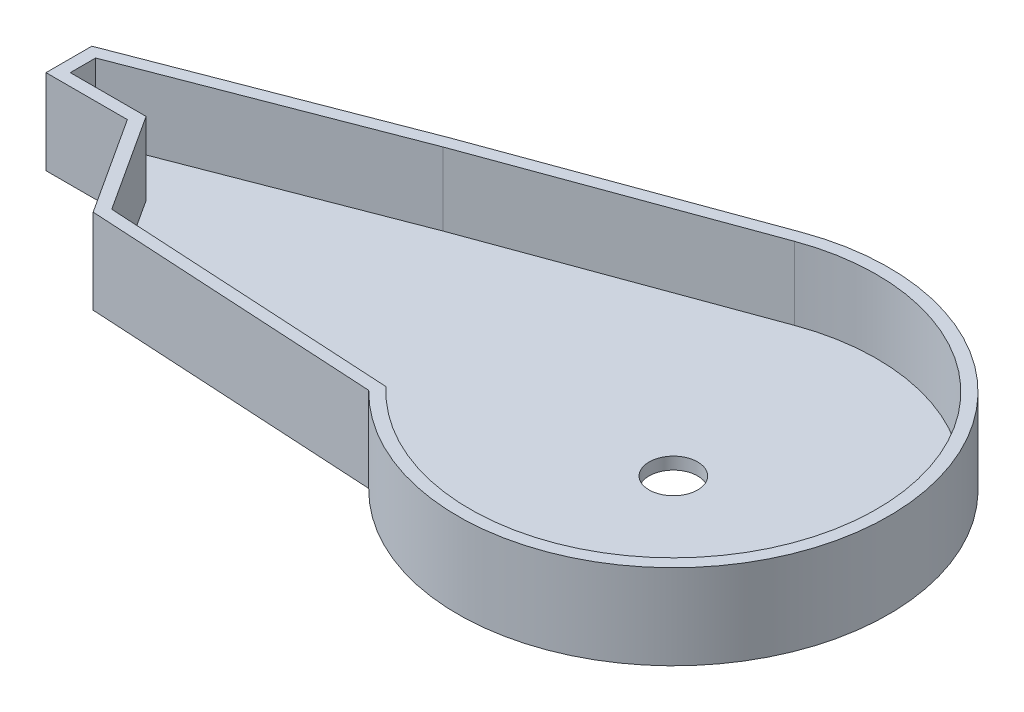
ISO-10303-21;
HEADER;
FILE_DESCRIPTION(('STEP AP214'),'2;1');
FILE_NAME('part.step','',(''),(''),'','','');
FILE_SCHEMA(('AUTOMOTIVE_DESIGN { 1 0 10303 214 1 1 1 1 }'));
ENDSEC;
DATA;
#1=APPLICATION_CONTEXT('core data for automotive mechanical design processes');
#2=APPLICATION_PROTOCOL_DEFINITION('international standard','automotive_design',2000,#1);
#3=PRODUCT_CONTEXT('',#1,'mechanical');
#4=PRODUCT('Part','Part','',(#3));
#5=PRODUCT_RELATED_PRODUCT_CATEGORY('part','',(#4));
#6=PRODUCT_DEFINITION_FORMATION('','',#4);
#7=PRODUCT_DEFINITION_CONTEXT('part definition',#1,'design');
#8=PRODUCT_DEFINITION('design','',#6,#7);
#9=PRODUCT_DEFINITION_SHAPE('','',#8);
#10=(LENGTH_UNIT() NAMED_UNIT(*) SI_UNIT(.MILLI.,.METRE.));
#11=(NAMED_UNIT(*) PLANE_ANGLE_UNIT() SI_UNIT($,.RADIAN.));
#12=(NAMED_UNIT(*) SI_UNIT($,.STERADIAN.) SOLID_ANGLE_UNIT());
#13=UNCERTAINTY_MEASURE_WITH_UNIT(LENGTH_MEASURE(1.E-05),#10,'distance_accuracy_value','');
#14=(GEOMETRIC_REPRESENTATION_CONTEXT(3) GLOBAL_UNCERTAINTY_ASSIGNED_CONTEXT((#13)) GLOBAL_UNIT_ASSIGNED_CONTEXT((#10,
#11,#12)) REPRESENTATION_CONTEXT('',''));
#15=CARTESIAN_POINT('',(0.,0.,0.));
#16=DIRECTION('',(0.,0.,1.));
#17=DIRECTION('',(1.,0.,0.));
#18=AXIS2_PLACEMENT_3D('',#15,#16,#17);
#19=CARTESIAN_POINT('',(0.,17.78,0.));
#20=DIRECTION('',(0.,-1.,0.));
#21=DIRECTION('',(0.,0.,-1.));
#22=AXIS2_PLACEMENT_3D('',#19,#20,#21);
#23=CYLINDRICAL_SURFACE('',#22,5.08);
#24=CARTESIAN_POINT('',(0.,0.,0.));
#25=DIRECTION('',(0.,1.,0.));
#26=DIRECTION('',(0.,0.,1.));
#27=AXIS2_PLACEMENT_3D('',#24,#25,#26);
#28=CIRCLE('',#27,5.08);
#29=CARTESIAN_POINT('',(0.,0.,5.08));
#30=VERTEX_POINT('',#29);
#31=EDGE_CURVE('E141',#30,#30,#28,.T.);
#32=ORIENTED_EDGE('',*,*,#31,.F.);
#33=EDGE_LOOP('',(#32));
#34=FACE_BOUND('',#33,.T.);
#35=CARTESIAN_POINT('',(0.,2.54,0.));
#36=DIRECTION('',(0.,1.,0.));
#37=DIRECTION('',(0.,0.,1.));
#38=AXIS2_PLACEMENT_3D('',#35,#36,#37);
#39=CIRCLE('',#38,5.08);
#40=CARTESIAN_POINT('',(0.,2.54,5.08));
#41=VERTEX_POINT('',#40);
#42=EDGE_CURVE('E37',#41,#41,#39,.T.);
#43=ORIENTED_EDGE('',*,*,#42,.T.);
#44=EDGE_LOOP('',(#43));
#45=FACE_BOUND('',#44,.T.);
#46=ADVANCED_FACE('F33',(#34,#45),#23,.F.);
#47=CARTESIAN_POINT('',(0.,17.78,0.));
#48=DIRECTION('',(0.,1.,0.));
#49=DIRECTION('',(0.,0.,1.));
#50=AXIS2_PLACEMENT_3D('',#47,#48,#49);
#51=PLANE('',#50);
#52=CARTESIAN_POINT('',(0.,17.78,0.));
#53=DIRECTION('',(0.,1.,0.));
#54=DIRECTION('',(0.,0.,1.));
#55=AXIS2_PLACEMENT_3D('',#52,#53,#54);
#56=CIRCLE('',#55,42.545);
#57=CARTESIAN_POINT('',(-31.0140610014513,17.78,29.1239599848348));
#58=VERTEX_POINT('',#57);
#59=CARTESIAN_POINT('',(-14.5990451481157,17.78,-39.961793074927));
#60=VERTEX_POINT('',#59);
#61=EDGE_CURVE('E49',#58,#60,#56,.T.);
#62=ORIENTED_EDGE('',*,*,#61,.F.);
#63=DIRECTION('',(0.998397836065701,0.,0.0565841050059614));
#64=VECTOR('',#63,1.);
#65=CARTESIAN_POINT('',(-91.8513296053998,17.78,25.6760134142303));
#66=LINE('',#65,#64);
#67=CARTESIAN_POINT('',(-91.8513296053998,17.78,25.6760134142303));
#68=VERTEX_POINT('',#67);
#69=EDGE_CURVE('E198',#68,#58,#66,.T.);
#70=ORIENTED_EDGE('',*,*,#69,.F.);
#71=DIRECTION('',(0.543953149792658,0.,0.839115588480303));
#72=VECTOR('',#71,1.);
#73=CARTESIAN_POINT('',(-105.090165624104,17.78,5.25345738920635));
#74=LINE('',#73,#72);
#75=CARTESIAN_POINT('',(-105.090165624104,17.78,5.25345738920635));
#76=VERTEX_POINT('',#75);
#77=EDGE_CURVE('E202',#76,#68,#74,.T.);
#78=ORIENTED_EDGE('',*,*,#77,.F.);
#79=DIRECTION('',(1.,0.,0.));
#80=VECTOR('',#79,1.);
#81=CARTESIAN_POINT('',(-120.956324782808,17.78,5.25345738920635));
#82=LINE('',#81,#80);
#83=CARTESIAN_POINT('',(-120.956324782808,17.78,5.25345738920635));
#84=VERTEX_POINT('',#83);
#85=EDGE_CURVE('E205',#84,#76,#82,.T.);
#86=ORIENTED_EDGE('',*,*,#85,.F.);
#87=DIRECTION('',(0.,0.,1.));
#88=VECTOR('',#87,1.);
#89=CARTESIAN_POINT('',(-120.956324782808,17.78,-0.0552304426092067));
#90=LINE('',#89,#88);
#91=CARTESIAN_POINT('',(-120.956324782808,17.78,-0.0552304426092067));
#92=VERTEX_POINT('',#91);
#93=EDGE_CURVE('E208',#92,#84,#90,.T.);
#94=ORIENTED_EDGE('',*,*,#93,.F.);
#95=DIRECTION('',(-0.933112963053806,0.,0.359583367497646));
#96=VECTOR('',#95,1.);
#97=CARTESIAN_POINT('',(-68.4659826084911,17.78,-20.2828499779477));
#98=LINE('',#97,#96);
#99=CARTESIAN_POINT('',(-68.4659826084911,17.78,-20.2828499779477));
#100=VERTEX_POINT('',#99);
#101=EDGE_CURVE('E211',#100,#92,#98,.T.);
#102=ORIENTED_EDGE('',*,*,#101,.F.);
#103=DIRECTION('',(-0.93928294922851,0.,0.343143616126824));
#104=VECTOR('',#103,1.);
#105=CARTESIAN_POINT('',(-14.5990451481157,17.78,-39.9617930749269));
#106=LINE('',#105,#104);
#107=EDGE_CURVE('E214',#60,#100,#106,.T.);
#108=ORIENTED_EDGE('',*,*,#107,.F.);
#109=EDGE_LOOP('',(#62,#70,#78,#86,#94,#102,#108));
#110=FACE_BOUND('',#109,.T.);
#111=CARTESIAN_POINT('',(0.,17.78,0.));
#112=DIRECTION('',(0.,1.,0.));
#113=DIRECTION('',(0.,0.,1.));
#114=AXIS2_PLACEMENT_3D('',#111,#112,#113);
#115=CIRCLE('',#114,45.085);
#116=CARTESIAN_POINT('',(-32.1540117994862,17.78,31.6034294056594));
#117=VERTEX_POINT('',#116);
#118=CARTESIAN_POINT('',(-15.4706299330779,17.78,-42.3475717659673));
#119=VERTEX_POINT('',#118);
#120=EDGE_CURVE('E151',#117,#119,#115,.T.);
#121=ORIENTED_EDGE('',*,*,#120,.T.);
#122=DIRECTION('',(-0.93928294922851,0.,0.343143616126824));
#123=VECTOR('',#122,1.);
#124=CARTESIAN_POINT('',(-15.4706299330779,17.78,-42.3475717659673));
#125=LINE('',#124,#123);
#126=CARTESIAN_POINT('',(-69.3585146772244,17.78,-22.6609761009231));
#127=VERTEX_POINT('',#126);
#128=EDGE_CURVE('E96',#119,#127,#125,.T.);
#129=ORIENTED_EDGE('',*,*,#128,.T.);
#130=DIRECTION('',(-0.933112963053806,0.,0.359583367497646));
#131=VECTOR('',#130,1.);
#132=CARTESIAN_POINT('',(-69.3585146772244,17.78,-22.6609761009231));
#133=LINE('',#132,#131);
#134=CARTESIAN_POINT('',(-123.496324782808,17.78,-1.79849016673993));
#135=VERTEX_POINT('',#134);
#136=EDGE_CURVE('E164',#127,#135,#133,.T.);
#137=ORIENTED_EDGE('',*,*,#136,.T.);
#138=DIRECTION('',(0.,0.,1.));
#139=VECTOR('',#138,1.);
#140=CARTESIAN_POINT('',(-123.496324782808,17.78,-1.79849016673993));
#141=LINE('',#140,#139);
#142=CARTESIAN_POINT('',(-123.496324782808,17.78,7.79345738920635));
#143=VERTEX_POINT('',#142);
#144=EDGE_CURVE('E116',#135,#143,#141,.T.);
#145=ORIENTED_EDGE('',*,*,#144,.T.);
#146=DIRECTION('',(1.,0.,0.));
#147=VECTOR('',#146,1.);
#148=CARTESIAN_POINT('',(-123.496324782808,17.78,7.79345738920635));
#149=LINE('',#148,#147);
#150=CARTESIAN_POINT('',(-106.470617871004,17.78,7.79345738920635));
#151=VERTEX_POINT('',#150);
#152=EDGE_CURVE('E109',#143,#151,#149,.T.);
#153=ORIENTED_EDGE('',*,*,#152,.T.);
#154=DIRECTION('',(0.543953149792658,0.,0.839115588480304));
#155=VECTOR('',#154,1.);
#156=CARTESIAN_POINT('',(-106.470617871004,17.78,7.79345738920635));
#157=LINE('',#156,#155);
#158=CARTESIAN_POINT('',(-93.2816899815776,17.78,28.1390238990769));
#159=VERTEX_POINT('',#158);
#160=EDGE_CURVE('E113',#151,#159,#157,.T.);
#161=ORIENTED_EDGE('',*,*,#160,.T.);
#162=DIRECTION('',(0.998397836065701,0.,0.0565841050059614));
#163=VECTOR('',#162,1.);
#164=CARTESIAN_POINT('',(-32.1540117994862,17.78,31.6034294056594));
#165=LINE('',#164,#163);
#166=EDGE_CURVE('E58',#159,#117,#165,.T.);
#167=ORIENTED_EDGE('',*,*,#166,.T.);
#168=EDGE_LOOP('',(#121,#129,#137,#145,#153,#161,#167));
#169=FACE_BOUND('',#168,.T.);
#170=ADVANCED_FACE('F111',(#110,#169),#51,.T.);
#171=CARTESIAN_POINT('',(0.,0.,0.));
#172=DIRECTION('',(0.,1.,0.));
#173=DIRECTION('',(0.,0.,1.));
#174=AXIS2_PLACEMENT_3D('',#171,#172,#173);
#175=PLANE('',#174);
#176=CARTESIAN_POINT('',(0.,0.,0.));
#177=DIRECTION('',(0.,1.,0.));
#178=DIRECTION('',(0.,0.,1.));
#179=AXIS2_PLACEMENT_3D('',#176,#177,#178);
#180=CIRCLE('',#179,45.085);
#181=CARTESIAN_POINT('',(-32.1540117994862,0.,31.6034294056594));
#182=VERTEX_POINT('',#181);
#183=CARTESIAN_POINT('',(-15.4706299330779,0.,-42.3475717659673));
#184=VERTEX_POINT('',#183);
#185=EDGE_CURVE('E137',#182,#184,#180,.T.);
#186=ORIENTED_EDGE('',*,*,#185,.F.);
#187=DIRECTION('',(0.998397836065701,0.,0.0565841050059614));
#188=VECTOR('',#187,1.);
#189=CARTESIAN_POINT('',(-32.1540117994862,0.,31.6034294056594));
#190=LINE('',#189,#188);
#191=CARTESIAN_POINT('',(-93.2816899815776,0.,28.1390238990769));
#192=VERTEX_POINT('',#191);
#193=EDGE_CURVE('E88',#192,#182,#190,.T.);
#194=ORIENTED_EDGE('',*,*,#193,.F.);
#195=DIRECTION('',(0.543953149792658,0.,0.839115588480304));
#196=VECTOR('',#195,1.);
#197=CARTESIAN_POINT('',(-106.470617871004,0.,7.79345738920635));
#198=LINE('',#197,#196);
#199=CARTESIAN_POINT('',(-106.470617871004,0.,7.79345738920635));
#200=VERTEX_POINT('',#199);
#201=EDGE_CURVE('E148',#200,#192,#198,.T.);
#202=ORIENTED_EDGE('',*,*,#201,.F.);
#203=DIRECTION('',(1.,0.,0.));
#204=VECTOR('',#203,1.);
#205=CARTESIAN_POINT('',(-123.496324782808,0.,7.79345738920635));
#206=LINE('',#205,#204);
#207=CARTESIAN_POINT('',(-123.496324782808,0.,7.79345738920635));
#208=VERTEX_POINT('',#207);
#209=EDGE_CURVE('E125',#208,#200,#206,.T.);
#210=ORIENTED_EDGE('',*,*,#209,.F.);
#211=DIRECTION('',(0.,0.,1.));
#212=VECTOR('',#211,1.);
#213=CARTESIAN_POINT('',(-123.496324782808,0.,-1.79849016673993));
#214=LINE('',#213,#212);
#215=CARTESIAN_POINT('',(-123.496324782808,0.,-1.79849016673993));
#216=VERTEX_POINT('',#215);
#217=EDGE_CURVE('E145',#216,#208,#214,.T.);
#218=ORIENTED_EDGE('',*,*,#217,.F.);
#219=DIRECTION('',(-0.933112963053806,0.,0.359583367497646));
#220=VECTOR('',#219,1.);
#221=CARTESIAN_POINT('',(-69.3585146772244,0.,-22.6609761009231));
#222=LINE('',#221,#220);
#223=CARTESIAN_POINT('',(-69.3585146772244,0.,-22.6609761009231));
#224=VERTEX_POINT('',#223);
#225=EDGE_CURVE('E143',#224,#216,#222,.T.);
#226=ORIENTED_EDGE('',*,*,#225,.F.);
#227=DIRECTION('',(-0.93928294922851,0.,0.343143616126824));
#228=VECTOR('',#227,1.);
#229=CARTESIAN_POINT('',(-15.4706299330779,0.,-42.3475717659673));
#230=LINE('',#229,#228);
#231=EDGE_CURVE('E140',#184,#224,#230,.T.);
#232=ORIENTED_EDGE('',*,*,#231,.F.);
#233=EDGE_LOOP('',(#186,#194,#202,#210,#218,#226,#232));
#234=FACE_BOUND('',#233,.T.);
#235=ORIENTED_EDGE('',*,*,#31,.T.);
#236=EDGE_LOOP('',(#235));
#237=FACE_BOUND('',#236,.T.);
#238=ADVANCED_FACE('F168',(#234,#237),#175,.F.);
#239=CARTESIAN_POINT('',(0.,17.78,0.));
#240=DIRECTION('',(0.,-1.,0.));
#241=DIRECTION('',(0.,0.,-1.));
#242=AXIS2_PLACEMENT_3D('',#239,#240,#241);
#243=CYLINDRICAL_SURFACE('',#242,45.085);
#244=ORIENTED_EDGE('',*,*,#185,.T.);
#245=DIRECTION('',(0.,-1.,0.));
#246=VECTOR('',#245,1.);
#247=CARTESIAN_POINT('',(-15.4706299330779,17.78,-42.3475717659673));
#248=LINE('',#247,#246);
#249=EDGE_CURVE('E11',#119,#184,#248,.T.);
#250=ORIENTED_EDGE('',*,*,#249,.F.);
#251=ORIENTED_EDGE('',*,*,#120,.F.);
#252=DIRECTION('',(0.,-1.,0.));
#253=VECTOR('',#252,1.);
#254=CARTESIAN_POINT('',(-32.1540117994862,17.78,31.6034294056594));
#255=LINE('',#254,#253);
#256=EDGE_CURVE('E133',#117,#182,#255,.T.);
#257=ORIENTED_EDGE('',*,*,#256,.T.);
#258=EDGE_LOOP('',(#244,#250,#251,#257));
#259=FACE_BOUND('',#258,.T.);
#260=ADVANCED_FACE('F35',(#259),#243,.T.);
#261=CARTESIAN_POINT('',(-15.4706299330779,17.78,-42.3475717659673));
#262=DIRECTION('',(0.343143616126824,0.,0.93928294922851));
#263=DIRECTION('',(0.93928294922851,0.,-0.343143616126824));
#264=AXIS2_PLACEMENT_3D('',#261,#262,#263);
#265=PLANE('',#264);
#266=ORIENTED_EDGE('',*,*,#231,.T.);
#267=DIRECTION('',(0.,-1.,0.));
#268=VECTOR('',#267,1.);
#269=CARTESIAN_POINT('',(-69.3585146772244,17.78,-22.6609761009231));
#270=LINE('',#269,#268);
#271=EDGE_CURVE('E42',#127,#224,#270,.T.);
#272=ORIENTED_EDGE('',*,*,#271,.F.);
#273=ORIENTED_EDGE('',*,*,#128,.F.);
#274=ORIENTED_EDGE('',*,*,#249,.T.);
#275=EDGE_LOOP('',(#266,#272,#273,#274));
#276=FACE_BOUND('',#275,.T.);
#277=ADVANCED_FACE('F325',(#276),#265,.F.);
#278=CARTESIAN_POINT('',(-69.3585146772244,17.78,-22.6609761009231));
#279=DIRECTION('',(0.359583367497646,0.,0.933112963053805));
#280=DIRECTION('',(0.933112963053806,0.,-0.359583367497646));
#281=AXIS2_PLACEMENT_3D('',#278,#279,#280);
#282=PLANE('',#281);
#283=ORIENTED_EDGE('',*,*,#225,.T.);
#284=DIRECTION('',(0.,-1.,0.));
#285=VECTOR('',#284,1.);
#286=CARTESIAN_POINT('',(-123.496324782808,17.78,-1.79849016673993));
#287=LINE('',#286,#285);
#288=EDGE_CURVE('E155',#135,#216,#287,.T.);
#289=ORIENTED_EDGE('',*,*,#288,.F.);
#290=ORIENTED_EDGE('',*,*,#136,.F.);
#291=ORIENTED_EDGE('',*,*,#271,.T.);
#292=EDGE_LOOP('',(#283,#289,#290,#291));
#293=FACE_BOUND('',#292,.T.);
#294=ADVANCED_FACE('F162',(#293),#282,.F.);
#295=CARTESIAN_POINT('',(-123.496324782808,17.78,-1.79849016673993));
#296=DIRECTION('',(1.,0.,0.));
#297=DIRECTION('',(0.,0.,-1.));
#298=AXIS2_PLACEMENT_3D('',#295,#296,#297);
#299=PLANE('',#298);
#300=ORIENTED_EDGE('',*,*,#217,.T.);
#301=DIRECTION('',(0.,-1.,0.));
#302=VECTOR('',#301,1.);
#303=CARTESIAN_POINT('',(-123.496324782808,17.78,7.79345738920635));
#304=LINE('',#303,#302);
#305=EDGE_CURVE('E128',#143,#208,#304,.T.);
#306=ORIENTED_EDGE('',*,*,#305,.F.);
#307=ORIENTED_EDGE('',*,*,#144,.F.);
#308=ORIENTED_EDGE('',*,*,#288,.T.);
#309=EDGE_LOOP('',(#300,#306,#307,#308));
#310=FACE_BOUND('',#309,.T.);
#311=ADVANCED_FACE('F171',(#310),#299,.F.);
#312=CARTESIAN_POINT('',(-123.496324782808,17.78,7.79345738920635));
#313=DIRECTION('',(0.,0.,-1.));
#314=DIRECTION('',(-1.,0.,0.));
#315=AXIS2_PLACEMENT_3D('',#312,#313,#314);
#316=PLANE('',#315);
#317=ORIENTED_EDGE('',*,*,#209,.T.);
#318=DIRECTION('',(0.,-1.,0.));
#319=VECTOR('',#318,1.);
#320=CARTESIAN_POINT('',(-106.470617871004,17.78,7.79345738920635));
#321=LINE('',#320,#319);
#322=EDGE_CURVE('E122',#151,#200,#321,.T.);
#323=ORIENTED_EDGE('',*,*,#322,.F.);
#324=ORIENTED_EDGE('',*,*,#152,.F.);
#325=ORIENTED_EDGE('',*,*,#305,.T.);
#326=EDGE_LOOP('',(#317,#323,#324,#325));
#327=FACE_BOUND('',#326,.T.);
#328=ADVANCED_FACE('F123',(#327),#316,.F.);
#329=CARTESIAN_POINT('',(-106.470617871004,17.78,7.79345738920635));
#330=DIRECTION('',(0.839115588480304,0.,-0.543953149792658));
#331=DIRECTION('',(-0.543953149792658,0.,-0.839115588480304));
#332=AXIS2_PLACEMENT_3D('',#329,#330,#331);
#333=PLANE('',#332);
#334=ORIENTED_EDGE('',*,*,#201,.T.);
#335=DIRECTION('',(0.,-1.,0.));
#336=VECTOR('',#335,1.);
#337=CARTESIAN_POINT('',(-93.2816899815776,17.78,28.1390238990769));
#338=LINE('',#337,#336);
#339=EDGE_CURVE('E129',#159,#192,#338,.T.);
#340=ORIENTED_EDGE('',*,*,#339,.F.);
#341=ORIENTED_EDGE('',*,*,#160,.F.);
#342=ORIENTED_EDGE('',*,*,#322,.T.);
#343=EDGE_LOOP('',(#334,#340,#341,#342));
#344=FACE_BOUND('',#343,.T.);
#345=ADVANCED_FACE('F131',(#344),#333,.F.);
#346=CARTESIAN_POINT('',(-32.1540117994862,17.78,31.6034294056594));
#347=DIRECTION('',(0.0565841050059614,0.,-0.998397836065701));
#348=DIRECTION('',(-0.998397836065701,0.,-0.0565841050059614));
#349=AXIS2_PLACEMENT_3D('',#346,#347,#348);
#350=PLANE('',#349);
#351=ORIENTED_EDGE('',*,*,#193,.T.);
#352=ORIENTED_EDGE('',*,*,#256,.F.);
#353=ORIENTED_EDGE('',*,*,#166,.F.);
#354=ORIENTED_EDGE('',*,*,#339,.T.);
#355=EDGE_LOOP('',(#351,#352,#353,#354));
#356=FACE_BOUND('',#355,.T.);
#357=ADVANCED_FACE('F315',(#356),#350,.F.);
#358=CARTESIAN_POINT('',(0.,2.54,0.));
#359=DIRECTION('',(0.,1.,0.));
#360=DIRECTION('',(0.,0.,1.));
#361=AXIS2_PLACEMENT_3D('',#358,#359,#360);
#362=CYLINDRICAL_SURFACE('',#361,42.545);
#363=ORIENTED_EDGE('',*,*,#61,.T.);
#364=DIRECTION('',(0.,1.,0.));
#365=VECTOR('',#364,1.);
#366=CARTESIAN_POINT('',(-14.5990451481157,2.54,-39.9617930749269));
#367=LINE('',#366,#365);
#368=CARTESIAN_POINT('',(-14.5990451481157,2.54,-39.9617930749269));
#369=VERTEX_POINT('',#368);
#370=EDGE_CURVE('E178',#369,#60,#367,.T.);
#371=ORIENTED_EDGE('',*,*,#370,.F.);
#372=CARTESIAN_POINT('',(0.,2.54,0.));
#373=DIRECTION('',(0.,1.,0.));
#374=DIRECTION('',(0.,0.,1.));
#375=AXIS2_PLACEMENT_3D('',#372,#373,#374);
#376=CIRCLE('',#375,42.545);
#377=CARTESIAN_POINT('',(-31.0140610014513,2.54,29.1239599848348));
#378=VERTEX_POINT('',#377);
#379=EDGE_CURVE('E201',#378,#369,#376,.T.);
#380=ORIENTED_EDGE('',*,*,#379,.F.);
#381=DIRECTION('',(0.,1.,0.));
#382=VECTOR('',#381,1.);
#383=CARTESIAN_POINT('',(-31.0140610014513,2.54,29.1239599848348));
#384=LINE('',#383,#382);
#385=EDGE_CURVE('E196',#378,#58,#384,.T.);
#386=ORIENTED_EDGE('',*,*,#385,.T.);
#387=EDGE_LOOP('',(#363,#371,#380,#386));
#388=FACE_BOUND('',#387,.T.);
#389=ADVANCED_FACE('F244',(#388),#362,.F.);
#390=CARTESIAN_POINT('',(-91.8513296053998,2.54,25.6760134142303));
#391=DIRECTION('',(-0.0565841050059614,0.,0.998397836065701));
#392=DIRECTION('',(0.998397836065701,0.,0.0565841050059614));
#393=AXIS2_PLACEMENT_3D('',#390,#391,#392);
#394=PLANE('',#393);
#395=ORIENTED_EDGE('',*,*,#69,.T.);
#396=ORIENTED_EDGE('',*,*,#385,.F.);
#397=DIRECTION('',(0.998397836065701,0.,0.0565841050059614));
#398=VECTOR('',#397,1.);
#399=CARTESIAN_POINT('',(-91.8513296053998,2.54,25.6760134142303));
#400=LINE('',#399,#398);
#401=CARTESIAN_POINT('',(-91.8513296053998,2.54,25.6760134142303));
#402=VERTEX_POINT('',#401);
#403=EDGE_CURVE('E181',#402,#378,#400,.T.);
#404=ORIENTED_EDGE('',*,*,#403,.F.);
#405=DIRECTION('',(0.,1.,0.));
#406=VECTOR('',#405,1.);
#407=CARTESIAN_POINT('',(-91.8513296053998,2.54,25.6760134142303));
#408=LINE('',#407,#406);
#409=EDGE_CURVE('E193',#402,#68,#408,.T.);
#410=ORIENTED_EDGE('',*,*,#409,.T.);
#411=EDGE_LOOP('',(#395,#396,#404,#410));
#412=FACE_BOUND('',#411,.T.);
#413=ADVANCED_FACE('F262',(#412),#394,.F.);
#414=CARTESIAN_POINT('',(-105.090165624104,2.54,5.25345738920635));
#415=DIRECTION('',(-0.839115588480303,0.,0.543953149792658));
#416=DIRECTION('',(0.543953149792658,0.,0.839115588480303));
#417=AXIS2_PLACEMENT_3D('',#414,#415,#416);
#418=PLANE('',#417);
#419=ORIENTED_EDGE('',*,*,#77,.T.);
#420=ORIENTED_EDGE('',*,*,#409,.F.);
#421=DIRECTION('',(0.543953149792658,0.,0.839115588480303));
#422=VECTOR('',#421,1.);
#423=CARTESIAN_POINT('',(-105.090165624104,2.54,5.25345738920635));
#424=LINE('',#423,#422);
#425=CARTESIAN_POINT('',(-105.090165624104,2.54,5.25345738920635));
#426=VERTEX_POINT('',#425);
#427=EDGE_CURVE('E220',#426,#402,#424,.T.);
#428=ORIENTED_EDGE('',*,*,#427,.F.);
#429=DIRECTION('',(0.,1.,0.));
#430=VECTOR('',#429,1.);
#431=CARTESIAN_POINT('',(-105.090165624104,2.54,5.25345738920635));
#432=LINE('',#431,#430);
#433=EDGE_CURVE('E190',#426,#76,#432,.T.);
#434=ORIENTED_EDGE('',*,*,#433,.T.);
#435=EDGE_LOOP('',(#419,#420,#428,#434));
#436=FACE_BOUND('',#435,.T.);
#437=ADVANCED_FACE('F267',(#436),#418,.F.);
#438=CARTESIAN_POINT('',(-120.956324782808,2.54,5.25345738920635));
#439=DIRECTION('',(0.,0.,1.));
#440=DIRECTION('',(1.,0.,0.));
#441=AXIS2_PLACEMENT_3D('',#438,#439,#440);
#442=PLANE('',#441);
#443=ORIENTED_EDGE('',*,*,#85,.T.);
#444=ORIENTED_EDGE('',*,*,#433,.F.);
#445=DIRECTION('',(1.,0.,0.));
#446=VECTOR('',#445,1.);
#447=CARTESIAN_POINT('',(-120.956324782808,2.54,5.25345738920635));
#448=LINE('',#447,#446);
#449=CARTESIAN_POINT('',(-120.956324782808,2.54,5.25345738920635));
#450=VERTEX_POINT('',#449);
#451=EDGE_CURVE('E223',#450,#426,#448,.T.);
#452=ORIENTED_EDGE('',*,*,#451,.F.);
#453=DIRECTION('',(0.,1.,0.));
#454=VECTOR('',#453,1.);
#455=CARTESIAN_POINT('',(-120.956324782808,2.54,5.25345738920635));
#456=LINE('',#455,#454);
#457=EDGE_CURVE('E187',#450,#84,#456,.T.);
#458=ORIENTED_EDGE('',*,*,#457,.T.);
#459=EDGE_LOOP('',(#443,#444,#452,#458));
#460=FACE_BOUND('',#459,.T.);
#461=ADVANCED_FACE('F290',(#460),#442,.F.);
#462=CARTESIAN_POINT('',(-120.956324782808,2.54,-0.0552304426092067));
#463=DIRECTION('',(-1.,0.,0.));
#464=DIRECTION('',(0.,0.,1.));
#465=AXIS2_PLACEMENT_3D('',#462,#463,#464);
#466=PLANE('',#465);
#467=ORIENTED_EDGE('',*,*,#93,.T.);
#468=ORIENTED_EDGE('',*,*,#457,.F.);
#469=DIRECTION('',(0.,0.,1.));
#470=VECTOR('',#469,1.);
#471=CARTESIAN_POINT('',(-120.956324782808,2.54,-0.0552304426092067));
#472=LINE('',#471,#470);
#473=CARTESIAN_POINT('',(-120.956324782808,2.54,-0.0552304426092067));
#474=VERTEX_POINT('',#473);
#475=EDGE_CURVE('E226',#474,#450,#472,.T.);
#476=ORIENTED_EDGE('',*,*,#475,.F.);
#477=DIRECTION('',(0.,1.,0.));
#478=VECTOR('',#477,1.);
#479=CARTESIAN_POINT('',(-120.956324782808,2.54,-0.0552304426092067));
#480=LINE('',#479,#478);
#481=EDGE_CURVE('E184',#474,#92,#480,.T.);
#482=ORIENTED_EDGE('',*,*,#481,.T.);
#483=EDGE_LOOP('',(#467,#468,#476,#482));
#484=FACE_BOUND('',#483,.T.);
#485=ADVANCED_FACE('F292',(#484),#466,.F.);
#486=CARTESIAN_POINT('',(-68.4659826084911,2.54,-20.2828499779477));
#487=DIRECTION('',(-0.359583367497646,0.,-0.933112963053806));
#488=DIRECTION('',(-0.933112963053806,0.,0.359583367497646));
#489=AXIS2_PLACEMENT_3D('',#486,#487,#488);
#490=PLANE('',#489);
#491=ORIENTED_EDGE('',*,*,#101,.T.);
#492=ORIENTED_EDGE('',*,*,#481,.F.);
#493=DIRECTION('',(-0.933112963053806,0.,0.359583367497646));
#494=VECTOR('',#493,1.);
#495=CARTESIAN_POINT('',(-68.4659826084911,2.54,-20.2828499779477));
#496=LINE('',#495,#494);
#497=CARTESIAN_POINT('',(-68.4659826084911,2.54,-20.2828499779477));
#498=VERTEX_POINT('',#497);
#499=EDGE_CURVE('E229',#498,#474,#496,.T.);
#500=ORIENTED_EDGE('',*,*,#499,.F.);
#501=DIRECTION('',(0.,1.,0.));
#502=VECTOR('',#501,1.);
#503=CARTESIAN_POINT('',(-68.4659826084911,2.54,-20.2828499779477));
#504=LINE('',#503,#502);
#505=EDGE_CURVE('E180',#498,#100,#504,.T.);
#506=ORIENTED_EDGE('',*,*,#505,.T.);
#507=EDGE_LOOP('',(#491,#492,#500,#506));
#508=FACE_BOUND('',#507,.T.);
#509=ADVANCED_FACE('F282',(#508),#490,.F.);
#510=CARTESIAN_POINT('',(-14.5990451481157,2.54,-39.9617930749269));
#511=DIRECTION('',(-0.343143616126824,0.,-0.93928294922851));
#512=DIRECTION('',(-0.93928294922851,0.,0.343143616126824));
#513=AXIS2_PLACEMENT_3D('',#510,#511,#512);
#514=PLANE('',#513);
#515=ORIENTED_EDGE('',*,*,#107,.T.);
#516=ORIENTED_EDGE('',*,*,#505,.F.);
#517=DIRECTION('',(-0.93928294922851,0.,0.343143616126824));
#518=VECTOR('',#517,1.);
#519=CARTESIAN_POINT('',(-14.5990451481157,2.54,-39.9617930749269));
#520=LINE('',#519,#518);
#521=EDGE_CURVE('E232',#369,#498,#520,.T.);
#522=ORIENTED_EDGE('',*,*,#521,.F.);
#523=ORIENTED_EDGE('',*,*,#370,.T.);
#524=EDGE_LOOP('',(#515,#516,#522,#523));
#525=FACE_BOUND('',#524,.T.);
#526=ADVANCED_FACE('F276',(#525),#514,.F.);
#527=CARTESIAN_POINT('',(0.,2.54,0.));
#528=DIRECTION('',(0.,1.,0.));
#529=DIRECTION('',(0.,0.,1.));
#530=AXIS2_PLACEMENT_3D('',#527,#528,#529);
#531=PLANE('',#530);
#532=ORIENTED_EDGE('',*,*,#42,.F.);
#533=EDGE_LOOP('',(#532));
#534=FACE_BOUND('',#533,.T.);
#535=ORIENTED_EDGE('',*,*,#379,.T.);
#536=ORIENTED_EDGE('',*,*,#521,.T.);
#537=ORIENTED_EDGE('',*,*,#499,.T.);
#538=ORIENTED_EDGE('',*,*,#475,.T.);
#539=ORIENTED_EDGE('',*,*,#451,.T.);
#540=ORIENTED_EDGE('',*,*,#427,.T.);
#541=ORIENTED_EDGE('',*,*,#403,.T.);
#542=EDGE_LOOP('',(#535,#536,#537,#538,#539,#540,#541));
#543=FACE_BOUND('',#542,.T.);
#544=ADVANCED_FACE('F239',(#534,#543),#531,.T.);
#545=CLOSED_SHELL('',(#46,#170,#238,#260,#277,#294,#311,#328,#345,#357,#389,#413,#437,#461,#485,
#509,#526,#544));
#546=MANIFOLD_SOLID_BREP('B2',#545);
#547=ADVANCED_BREP_SHAPE_REPRESENTATION('',(#18,#546),#14);
#548=SHAPE_DEFINITION_REPRESENTATION(#9,#547);
ENDSEC;
END-ISO-10303-21;
